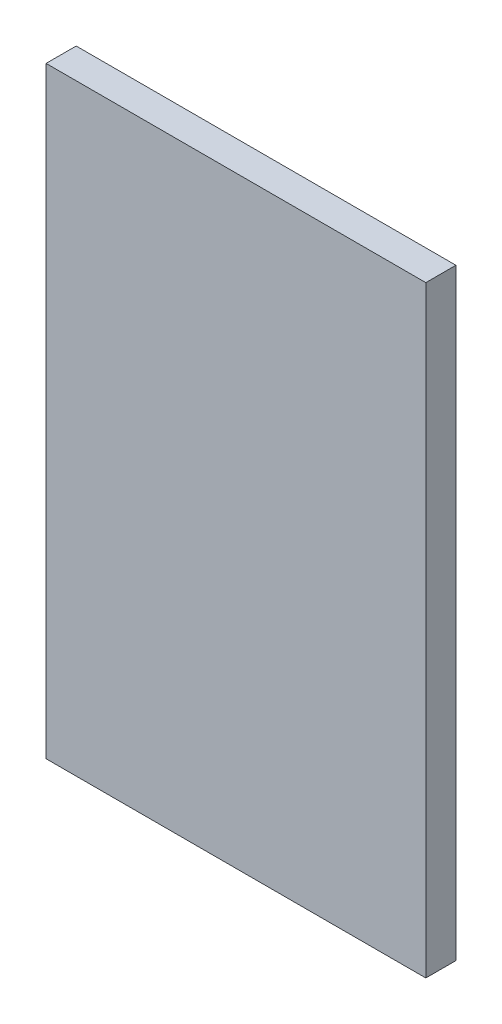
ISO-10303-21;
HEADER;
FILE_DESCRIPTION(('STEP AP214'),'2;1');
FILE_NAME('part.step','',(''),(''),'','','');
FILE_SCHEMA(('AUTOMOTIVE_DESIGN { 1 0 10303 214 1 1 1 1 }'));
ENDSEC;
DATA;
#1=APPLICATION_CONTEXT('core data for automotive mechanical design processes');
#2=APPLICATION_PROTOCOL_DEFINITION('international standard','automotive_design',2000,#1);
#3=PRODUCT_CONTEXT('',#1,'mechanical');
#4=PRODUCT('Part','Part','',(#3));
#5=PRODUCT_RELATED_PRODUCT_CATEGORY('part','',(#4));
#6=PRODUCT_DEFINITION_FORMATION('','',#4);
#7=PRODUCT_DEFINITION_CONTEXT('part definition',#1,'design');
#8=PRODUCT_DEFINITION('design','',#6,#7);
#9=PRODUCT_DEFINITION_SHAPE('','',#8);
#10=(LENGTH_UNIT() NAMED_UNIT(*) SI_UNIT(.MILLI.,.METRE.));
#11=(NAMED_UNIT(*) PLANE_ANGLE_UNIT() SI_UNIT($,.RADIAN.));
#12=(NAMED_UNIT(*) SI_UNIT($,.STERADIAN.) SOLID_ANGLE_UNIT());
#13=UNCERTAINTY_MEASURE_WITH_UNIT(LENGTH_MEASURE(1.E-05),#10,'distance_accuracy_value','');
#14=(GEOMETRIC_REPRESENTATION_CONTEXT(3) GLOBAL_UNCERTAINTY_ASSIGNED_CONTEXT((#13)) GLOBAL_UNIT_ASSIGNED_CONTEXT((#10,
#11,#12)) REPRESENTATION_CONTEXT('',''));
#15=CARTESIAN_POINT('',(0.,0.,0.));
#16=DIRECTION('',(0.,0.,1.));
#17=DIRECTION('',(1.,0.,0.));
#18=AXIS2_PLACEMENT_3D('',#15,#16,#17);
#19=CARTESIAN_POINT('',(0.,0.,44.45));
#20=DIRECTION('',(1.,0.,0.));
#21=DIRECTION('',(0.,1.,0.));
#22=AXIS2_PLACEMENT_3D('',#19,#20,#21);
#23=PLANE('',#22);
#24=DIRECTION('',(0.,-1.,0.));
#25=VECTOR('',#24,1.);
#26=CARTESIAN_POINT('',(0.,0.,0.));
#27=LINE('',#26,#25);
#28=CARTESIAN_POINT('',(0.,0.,0.));
#29=VERTEX_POINT('',#28);
#30=CARTESIAN_POINT('',(1.088711004442E-13,-889.,0.));
#31=VERTEX_POINT('',#30);
#32=EDGE_CURVE('E298',#29,#31,#27,.T.);
#33=ORIENTED_EDGE('',*,*,#32,.T.);
#34=DIRECTION('',(0.,0.,-1.));
#35=VECTOR('',#34,1.);
#36=CARTESIAN_POINT('',(1.088711004442E-13,-889.,44.45));
#37=LINE('',#36,#35);
#38=CARTESIAN_POINT('',(1.088711004442E-13,-889.,44.45));
#39=VERTEX_POINT('',#38);
#40=EDGE_CURVE('E11',#39,#31,#37,.T.);
#41=ORIENTED_EDGE('',*,*,#40,.F.);
#42=DIRECTION('',(0.,-1.,0.));
#43=VECTOR('',#42,1.);
#44=CARTESIAN_POINT('',(0.,0.,44.45));
#45=LINE('',#44,#43);
#46=CARTESIAN_POINT('',(0.,0.,44.45));
#47=VERTEX_POINT('',#46);
#48=EDGE_CURVE('E299',#47,#39,#45,.T.);
#49=ORIENTED_EDGE('',*,*,#48,.F.);
#50=DIRECTION('',(0.,0.,-1.));
#51=VECTOR('',#50,1.);
#52=CARTESIAN_POINT('',(0.,0.,44.45));
#53=LINE('',#52,#51);
#54=EDGE_CURVE('E309',#47,#29,#53,.T.);
#55=ORIENTED_EDGE('',*,*,#54,.T.);
#56=EDGE_LOOP('',(#33,#41,#49,#55));
#57=FACE_BOUND('',#56,.T.);
#58=ADVANCED_FACE('F32',(#57),#23,.F.);
#59=CARTESIAN_POINT('',(1.088711004442E-13,-889.,44.45));
#60=DIRECTION('',(0.,1.,0.));
#61=DIRECTION('',(0.,0.,1.));
#62=AXIS2_PLACEMENT_3D('',#59,#60,#61);
#63=PLANE('',#62);
#64=DIRECTION('',(1.,0.,0.));
#65=VECTOR('',#64,1.);
#66=CARTESIAN_POINT('',(1.088711004442E-13,-889.,0.));
#67=LINE('',#66,#65);
#68=CARTESIAN_POINT('',(560.57,-889.,0.));
#69=VERTEX_POINT('',#68);
#70=EDGE_CURVE('E312',#31,#69,#67,.T.);
#71=ORIENTED_EDGE('',*,*,#70,.T.);
#72=DIRECTION('',(0.,0.,-1.));
#73=VECTOR('',#72,1.);
#74=CARTESIAN_POINT('',(560.57,-889.,44.45));
#75=LINE('',#74,#73);
#76=CARTESIAN_POINT('',(560.57,-889.,44.45));
#77=VERTEX_POINT('',#76);
#78=EDGE_CURVE('E39',#77,#69,#75,.T.);
#79=ORIENTED_EDGE('',*,*,#78,.F.);
#80=DIRECTION('',(1.,0.,0.));
#81=VECTOR('',#80,1.);
#82=CARTESIAN_POINT('',(1.088711004442E-13,-889.,44.45));
#83=LINE('',#82,#81);
#84=EDGE_CURVE('E302',#39,#77,#83,.T.);
#85=ORIENTED_EDGE('',*,*,#84,.F.);
#86=ORIENTED_EDGE('',*,*,#40,.T.);
#87=EDGE_LOOP('',(#71,#79,#85,#86));
#88=FACE_BOUND('',#87,.T.);
#89=ADVANCED_FACE('F342',(#88),#63,.F.);
#90=CARTESIAN_POINT('',(560.57,0.,44.45));
#91=DIRECTION('',(-1.,0.,0.));
#92=DIRECTION('',(0.,-1.,0.));
#93=AXIS2_PLACEMENT_3D('',#90,#91,#92);
#94=PLANE('',#93);
#95=DIRECTION('',(0.,1.,0.));
#96=VECTOR('',#95,1.);
#97=CARTESIAN_POINT('',(560.57,0.,0.));
#98=LINE('',#97,#96);
#99=CARTESIAN_POINT('',(560.57,0.,0.));
#100=VERTEX_POINT('',#99);
#101=EDGE_CURVE('E314',#69,#100,#98,.T.);
#102=ORIENTED_EDGE('',*,*,#101,.T.);
#103=DIRECTION('',(0.,0.,-1.));
#104=VECTOR('',#103,1.);
#105=CARTESIAN_POINT('',(560.57,0.,44.45));
#106=LINE('',#105,#104);
#107=CARTESIAN_POINT('',(560.57,0.,44.45));
#108=VERTEX_POINT('',#107);
#109=EDGE_CURVE('E319',#108,#100,#106,.T.);
#110=ORIENTED_EDGE('',*,*,#109,.F.);
#111=DIRECTION('',(0.,1.,0.));
#112=VECTOR('',#111,1.);
#113=CARTESIAN_POINT('',(560.57,0.,44.45));
#114=LINE('',#113,#112);
#115=EDGE_CURVE('E305',#77,#108,#114,.T.);
#116=ORIENTED_EDGE('',*,*,#115,.F.);
#117=ORIENTED_EDGE('',*,*,#78,.T.);
#118=EDGE_LOOP('',(#102,#110,#116,#117));
#119=FACE_BOUND('',#118,.T.);
#120=ADVANCED_FACE('F326',(#119),#94,.F.);
#121=CARTESIAN_POINT('',(0.,0.,44.45));
#122=DIRECTION('',(0.,-1.,0.));
#123=DIRECTION('',(0.,0.,-1.));
#124=AXIS2_PLACEMENT_3D('',#121,#122,#123);
#125=PLANE('',#124);
#126=DIRECTION('',(-1.,0.,0.));
#127=VECTOR('',#126,1.);
#128=CARTESIAN_POINT('',(0.,0.,0.));
#129=LINE('',#128,#127);
#130=EDGE_CURVE('E303',#100,#29,#129,.T.);
#131=ORIENTED_EDGE('',*,*,#130,.T.);
#132=ORIENTED_EDGE('',*,*,#54,.F.);
#133=DIRECTION('',(-1.,0.,0.));
#134=VECTOR('',#133,1.);
#135=CARTESIAN_POINT('',(0.,0.,44.45));
#136=LINE('',#135,#134);
#137=EDGE_CURVE('E307',#108,#47,#136,.T.);
#138=ORIENTED_EDGE('',*,*,#137,.F.);
#139=ORIENTED_EDGE('',*,*,#109,.T.);
#140=EDGE_LOOP('',(#131,#132,#138,#139));
#141=FACE_BOUND('',#140,.T.);
#142=ADVANCED_FACE('F335',(#141),#125,.F.);
#143=CARTESIAN_POINT('',(0.,0.,44.45));
#144=DIRECTION('',(0.,0.,1.));
#145=DIRECTION('',(1.,0.,0.));
#146=AXIS2_PLACEMENT_3D('',#143,#144,#145);
#147=PLANE('',#146);
#148=ORIENTED_EDGE('',*,*,#48,.T.);
#149=ORIENTED_EDGE('',*,*,#84,.T.);
#150=ORIENTED_EDGE('',*,*,#115,.T.);
#151=ORIENTED_EDGE('',*,*,#137,.T.);
#152=EDGE_LOOP('',(#148,#149,#150,#151));
#153=FACE_BOUND('',#152,.T.);
#154=ADVANCED_FACE('F341',(#153),#147,.T.);
#155=CARTESIAN_POINT('',(0.,0.,0.));
#156=DIRECTION('',(0.,0.,1.));
#157=DIRECTION('',(1.,0.,0.));
#158=AXIS2_PLACEMENT_3D('',#155,#156,#157);
#159=PLANE('',#158);
#160=DIRECTION('',(0.,-1.,0.));
#161=VECTOR('',#160,1.);
#162=CARTESIAN_POINT('',(391.634336198421,-63.5,0.));
#163=LINE('',#162,#161);
#164=CARTESIAN_POINT('',(391.634336198421,-63.5,0.));
#165=VERTEX_POINT('',#164);
#166=CARTESIAN_POINT('',(391.634336198421,-825.5,0.));
#167=VERTEX_POINT('',#166);
#168=EDGE_CURVE('E180',#165,#167,#163,.T.);
#169=ORIENTED_EDGE('',*,*,#168,.F.);
#170=DIRECTION('',(1.,0.,0.));
#171=VECTOR('',#170,1.);
#172=CARTESIAN_POINT('',(391.634336198421,-63.5,0.));
#173=LINE('',#172,#171);
#174=CARTESIAN_POINT('',(355.50566380158,-63.5,0.));
#175=VERTEX_POINT('',#174);
#176=EDGE_CURVE('E197',#175,#165,#173,.T.);
#177=ORIENTED_EDGE('',*,*,#176,.F.);
#178=DIRECTION('',(0.,-1.,0.));
#179=VECTOR('',#178,1.);
#180=CARTESIAN_POINT('',(355.50566380158,-63.5,0.));
#181=LINE('',#180,#179);
#182=CARTESIAN_POINT('',(355.50566380158,-825.5,0.));
#183=VERTEX_POINT('',#182);
#184=EDGE_CURVE('E205',#175,#183,#181,.T.);
#185=ORIENTED_EDGE('',*,*,#184,.T.);
#186=DIRECTION('',(1.,0.,0.));
#187=VECTOR('',#186,1.);
#188=CARTESIAN_POINT('',(391.634336198421,-825.5,0.));
#189=LINE('',#188,#187);
#190=EDGE_CURVE('E185',#183,#167,#189,.T.);
#191=ORIENTED_EDGE('',*,*,#190,.T.);
#192=EDGE_LOOP('',(#169,#177,#185,#191));
#193=FACE_BOUND('',#192,.T.);
#194=DIRECTION('',(0.,-1.,0.));
#195=VECTOR('',#194,1.);
#196=CARTESIAN_POINT('',(485.13433619842,-63.4999999999999,0.));
#197=LINE('',#196,#195);
#198=CARTESIAN_POINT('',(485.13433619842,-63.4999999999999,0.));
#199=VERTEX_POINT('',#198);
#200=CARTESIAN_POINT('',(485.134336198421,-825.5,0.));
#201=VERTEX_POINT('',#200);
#202=EDGE_CURVE('E234',#199,#201,#197,.T.);
#203=ORIENTED_EDGE('',*,*,#202,.F.);
#204=DIRECTION('',(1.,0.,0.));
#205=VECTOR('',#204,1.);
#206=CARTESIAN_POINT('',(485.13433619842,-63.4999999999999,0.));
#207=LINE('',#206,#205);
#208=CARTESIAN_POINT('',(449.00566380158,-63.4999999999999,0.));
#209=VERTEX_POINT('',#208);
#210=EDGE_CURVE('E223',#209,#199,#207,.T.);
#211=ORIENTED_EDGE('',*,*,#210,.F.);
#212=DIRECTION('',(0.,-1.,0.));
#213=VECTOR('',#212,1.);
#214=CARTESIAN_POINT('',(449.00566380158,-63.4999999999999,0.));
#215=LINE('',#214,#213);
#216=CARTESIAN_POINT('',(449.00566380158,-825.5,0.));
#217=VERTEX_POINT('',#216);
#218=EDGE_CURVE('E231',#209,#217,#215,.T.);
#219=ORIENTED_EDGE('',*,*,#218,.T.);
#220=DIRECTION('',(1.,0.,0.));
#221=VECTOR('',#220,1.);
#222=CARTESIAN_POINT('',(485.134336198421,-825.5,0.));
#223=LINE('',#222,#221);
#224=EDGE_CURVE('E212',#217,#201,#223,.T.);
#225=ORIENTED_EDGE('',*,*,#224,.T.);
#226=EDGE_LOOP('',(#203,#211,#219,#225));
#227=FACE_BOUND('',#226,.T.);
#228=DIRECTION('',(0.,-1.,0.));
#229=VECTOR('',#228,1.);
#230=CARTESIAN_POINT('',(205.06433619842,-63.5,0.));
#231=LINE('',#230,#229);
#232=CARTESIAN_POINT('',(205.06433619842,-63.5,0.));
#233=VERTEX_POINT('',#232);
#234=CARTESIAN_POINT('',(205.06433619842,-825.5,0.));
#235=VERTEX_POINT('',#234);
#236=EDGE_CURVE('E263',#233,#235,#231,.T.);
#237=ORIENTED_EDGE('',*,*,#236,.F.);
#238=DIRECTION('',(-1.,0.,0.));
#239=VECTOR('',#238,1.);
#240=CARTESIAN_POINT('',(168.935663801579,-63.5,0.));
#241=LINE('',#240,#239);
#242=CARTESIAN_POINT('',(168.935663801579,-63.5,0.));
#243=VERTEX_POINT('',#242);
#244=EDGE_CURVE('E253',#233,#243,#241,.T.);
#245=ORIENTED_EDGE('',*,*,#244,.T.);
#246=DIRECTION('',(0.,-1.,0.));
#247=VECTOR('',#246,1.);
#248=CARTESIAN_POINT('',(168.935663801579,-63.5,0.));
#249=LINE('',#248,#247);
#250=CARTESIAN_POINT('',(168.935663801579,-825.5,0.));
#251=VERTEX_POINT('',#250);
#252=EDGE_CURVE('E260',#243,#251,#249,.T.);
#253=ORIENTED_EDGE('',*,*,#252,.T.);
#254=DIRECTION('',(-1.,0.,0.));
#255=VECTOR('',#254,1.);
#256=CARTESIAN_POINT('',(168.935663801579,-825.5,0.));
#257=LINE('',#256,#255);
#258=EDGE_CURVE('E243',#235,#251,#257,.T.);
#259=ORIENTED_EDGE('',*,*,#258,.F.);
#260=EDGE_LOOP('',(#237,#245,#253,#259));
#261=FACE_BOUND('',#260,.T.);
#262=DIRECTION('',(0.,-1.,0.));
#263=VECTOR('',#262,1.);
#264=CARTESIAN_POINT('',(111.56433619842,-63.5,0.));
#265=LINE('',#264,#263);
#266=CARTESIAN_POINT('',(111.56433619842,-63.5,0.));
#267=VERTEX_POINT('',#266);
#268=CARTESIAN_POINT('',(111.56433619842,-825.5,0.));
#269=VERTEX_POINT('',#268);
#270=EDGE_CURVE('E293',#267,#269,#265,.T.);
#271=ORIENTED_EDGE('',*,*,#270,.F.);
#272=DIRECTION('',(-1.,0.,0.));
#273=VECTOR('',#272,1.);
#274=CARTESIAN_POINT('',(75.4356638015795,-63.5,0.));
#275=LINE('',#274,#273);
#276=CARTESIAN_POINT('',(75.4356638015795,-63.5,0.));
#277=VERTEX_POINT('',#276);
#278=EDGE_CURVE('E283',#267,#277,#275,.T.);
#279=ORIENTED_EDGE('',*,*,#278,.T.);
#280=DIRECTION('',(0.,-1.,0.));
#281=VECTOR('',#280,1.);
#282=CARTESIAN_POINT('',(75.4356638015795,-63.5,0.));
#283=LINE('',#282,#281);
#284=CARTESIAN_POINT('',(75.4356638015795,-825.5,0.));
#285=VERTEX_POINT('',#284);
#286=EDGE_CURVE('E290',#277,#285,#283,.T.);
#287=ORIENTED_EDGE('',*,*,#286,.T.);
#288=DIRECTION('',(-1.,0.,0.));
#289=VECTOR('',#288,1.);
#290=CARTESIAN_POINT('',(75.4356638015795,-825.5,0.));
#291=LINE('',#290,#289);
#292=EDGE_CURVE('E273',#269,#285,#291,.T.);
#293=ORIENTED_EDGE('',*,*,#292,.F.);
#294=EDGE_LOOP('',(#271,#279,#287,#293));
#295=FACE_BOUND('',#294,.T.);
#296=ORIENTED_EDGE('',*,*,#32,.F.);
#297=ORIENTED_EDGE('',*,*,#130,.F.);
#298=ORIENTED_EDGE('',*,*,#101,.F.);
#299=ORIENTED_EDGE('',*,*,#70,.F.);
#300=EDGE_LOOP('',(#296,#297,#298,#299));
#301=FACE_BOUND('',#300,.T.);
#302=ADVANCED_FACE('F332',(#193,#227,#261,#295,#301),#159,.F.);
#303=CARTESIAN_POINT('',(93.5,-63.5,3.95167314785035));
#304=DIRECTION('',(0.,-1.,0.));
#305=DIRECTION('',(0.,0.,-1.));
#306=AXIS2_PLACEMENT_3D('',#303,#304,#305);
#307=CYLINDRICAL_SURFACE('',#306,19.05);
#308=DIRECTION('',(0.,-1.,0.));
#309=VECTOR('',#308,1.);
#310=CARTESIAN_POINT('',(75.4356638015795,-63.5,10.));
#311=LINE('',#310,#309);
#312=CARTESIAN_POINT('',(75.4356638015795,-63.5,10.));
#313=VERTEX_POINT('',#312);
#314=CARTESIAN_POINT('',(75.4356638015795,-825.5,10.));
#315=VERTEX_POINT('',#314);
#316=EDGE_CURVE('E288',#313,#315,#311,.T.);
#317=ORIENTED_EDGE('',*,*,#316,.F.);
#318=CARTESIAN_POINT('',(93.5,-63.5,3.95167314785035));
#319=DIRECTION('',(0.,1.,0.));
#320=DIRECTION('',(0.,0.,1.));
#321=AXIS2_PLACEMENT_3D('',#318,#319,#320);
#322=CIRCLE('',#321,19.05);
#323=CARTESIAN_POINT('',(111.56433619842,-63.5,10.));
#324=VERTEX_POINT('',#323);
#325=EDGE_CURVE('E278',#313,#324,#322,.T.);
#326=ORIENTED_EDGE('',*,*,#325,.T.);
#327=DIRECTION('',(0.,-1.,0.));
#328=VECTOR('',#327,1.);
#329=CARTESIAN_POINT('',(111.56433619842,-63.5,10.));
#330=LINE('',#329,#328);
#331=CARTESIAN_POINT('',(111.56433619842,-825.5,10.));
#332=VERTEX_POINT('',#331);
#333=EDGE_CURVE('E296',#324,#332,#330,.T.);
#334=ORIENTED_EDGE('',*,*,#333,.T.);
#335=CARTESIAN_POINT('',(93.5,-825.5,3.95167314785035));
#336=DIRECTION('',(0.,1.,0.));
#337=DIRECTION('',(0.,0.,1.));
#338=AXIS2_PLACEMENT_3D('',#335,#336,#337);
#339=CIRCLE('',#338,19.05);
#340=EDGE_CURVE('E268',#315,#332,#339,.T.);
#341=ORIENTED_EDGE('',*,*,#340,.F.);
#342=EDGE_LOOP('',(#317,#326,#334,#341));
#343=FACE_BOUND('',#342,.T.);
#344=ADVANCED_FACE('F354',(#343),#307,.F.);
#345=CARTESIAN_POINT('',(111.56433619842,-63.5,0.));
#346=DIRECTION('',(-1.,0.,0.));
#347=DIRECTION('',(0.,0.,1.));
#348=AXIS2_PLACEMENT_3D('',#345,#346,#347);
#349=PLANE('',#348);
#350=ORIENTED_EDGE('',*,*,#333,.F.);
#351=DIRECTION('',(0.,0.,-1.));
#352=VECTOR('',#351,1.);
#353=CARTESIAN_POINT('',(111.56433619842,-63.5,0.));
#354=LINE('',#353,#352);
#355=EDGE_CURVE('E281',#324,#267,#354,.T.);
#356=ORIENTED_EDGE('',*,*,#355,.T.);
#357=ORIENTED_EDGE('',*,*,#270,.T.);
#358=DIRECTION('',(0.,0.,-1.));
#359=VECTOR('',#358,1.);
#360=CARTESIAN_POINT('',(111.56433619842,-825.5,0.));
#361=LINE('',#360,#359);
#362=EDGE_CURVE('E271',#332,#269,#361,.T.);
#363=ORIENTED_EDGE('',*,*,#362,.F.);
#364=EDGE_LOOP('',(#350,#356,#357,#363));
#365=FACE_BOUND('',#364,.T.);
#366=ADVANCED_FACE('F360',(#365),#349,.T.);
#367=CARTESIAN_POINT('',(75.4356638015795,-63.5,10.));
#368=DIRECTION('',(1.,0.,0.));
#369=DIRECTION('',(0.,0.,-1.));
#370=AXIS2_PLACEMENT_3D('',#367,#368,#369);
#371=PLANE('',#370);
#372=ORIENTED_EDGE('',*,*,#286,.F.);
#373=DIRECTION('',(0.,0.,1.));
#374=VECTOR('',#373,1.);
#375=CARTESIAN_POINT('',(75.4356638015795,-63.5,10.));
#376=LINE('',#375,#374);
#377=EDGE_CURVE('E286',#277,#313,#376,.T.);
#378=ORIENTED_EDGE('',*,*,#377,.T.);
#379=ORIENTED_EDGE('',*,*,#316,.T.);
#380=DIRECTION('',(0.,0.,1.));
#381=VECTOR('',#380,1.);
#382=CARTESIAN_POINT('',(75.4356638015795,-825.5,10.));
#383=LINE('',#382,#381);
#384=EDGE_CURVE('E275',#285,#315,#383,.T.);
#385=ORIENTED_EDGE('',*,*,#384,.F.);
#386=EDGE_LOOP('',(#372,#378,#379,#385));
#387=FACE_BOUND('',#386,.T.);
#388=ADVANCED_FACE('F364',(#387),#371,.T.);
#389=CARTESIAN_POINT('',(93.5,-63.5,3.95167314785035));
#390=DIRECTION('',(0.,1.,0.));
#391=DIRECTION('',(0.,0.,1.));
#392=AXIS2_PLACEMENT_3D('',#389,#390,#391);
#393=PLANE('',#392);
#394=ORIENTED_EDGE('',*,*,#325,.F.);
#395=ORIENTED_EDGE('',*,*,#377,.F.);
#396=ORIENTED_EDGE('',*,*,#278,.F.);
#397=ORIENTED_EDGE('',*,*,#355,.F.);
#398=EDGE_LOOP('',(#394,#395,#396,#397));
#399=FACE_BOUND('',#398,.T.);
#400=ADVANCED_FACE('F368',(#399),#393,.F.);
#401=CARTESIAN_POINT('',(93.5,-825.5,3.95167314785035));
#402=DIRECTION('',(0.,1.,0.));
#403=DIRECTION('',(0.,0.,1.));
#404=AXIS2_PLACEMENT_3D('',#401,#402,#403);
#405=PLANE('',#404);
#406=ORIENTED_EDGE('',*,*,#340,.T.);
#407=ORIENTED_EDGE('',*,*,#362,.T.);
#408=ORIENTED_EDGE('',*,*,#292,.T.);
#409=ORIENTED_EDGE('',*,*,#384,.T.);
#410=EDGE_LOOP('',(#406,#407,#408,#409));
#411=FACE_BOUND('',#410,.T.);
#412=ADVANCED_FACE('F372',(#411),#405,.T.);
#413=CARTESIAN_POINT('',(187.,-63.5,3.95167314785035));
#414=DIRECTION('',(0.,-1.,0.));
#415=DIRECTION('',(0.,0.,-1.));
#416=AXIS2_PLACEMENT_3D('',#413,#414,#415);
#417=CYLINDRICAL_SURFACE('',#416,19.05);
#418=DIRECTION('',(0.,-1.,0.));
#419=VECTOR('',#418,1.);
#420=CARTESIAN_POINT('',(168.935663801579,-63.5,10.));
#421=LINE('',#420,#419);
#422=CARTESIAN_POINT('',(168.935663801579,-63.5,10.));
#423=VERTEX_POINT('',#422);
#424=CARTESIAN_POINT('',(168.935663801579,-825.5,10.));
#425=VERTEX_POINT('',#424);
#426=EDGE_CURVE('E258',#423,#425,#421,.T.);
#427=ORIENTED_EDGE('',*,*,#426,.F.);
#428=CARTESIAN_POINT('',(187.,-63.5,3.95167314785035));
#429=DIRECTION('',(0.,1.,0.));
#430=DIRECTION('',(0.,0.,1.));
#431=AXIS2_PLACEMENT_3D('',#428,#429,#430);
#432=CIRCLE('',#431,19.05);
#433=CARTESIAN_POINT('',(205.06433619842,-63.5,10.));
#434=VERTEX_POINT('',#433);
#435=EDGE_CURVE('E248',#423,#434,#432,.T.);
#436=ORIENTED_EDGE('',*,*,#435,.T.);
#437=DIRECTION('',(0.,-1.,0.));
#438=VECTOR('',#437,1.);
#439=CARTESIAN_POINT('',(205.06433619842,-63.5,10.));
#440=LINE('',#439,#438);
#441=CARTESIAN_POINT('',(205.06433619842,-825.5,10.));
#442=VERTEX_POINT('',#441);
#443=EDGE_CURVE('E266',#434,#442,#440,.T.);
#444=ORIENTED_EDGE('',*,*,#443,.T.);
#445=CARTESIAN_POINT('',(187.,-825.5,3.95167314785035));
#446=DIRECTION('',(0.,1.,0.));
#447=DIRECTION('',(0.,0.,1.));
#448=AXIS2_PLACEMENT_3D('',#445,#446,#447);
#449=CIRCLE('',#448,19.05);
#450=EDGE_CURVE('E238',#425,#442,#449,.T.);
#451=ORIENTED_EDGE('',*,*,#450,.F.);
#452=EDGE_LOOP('',(#427,#436,#444,#451));
#453=FACE_BOUND('',#452,.T.);
#454=ADVANCED_FACE('F376',(#453),#417,.F.);
#455=CARTESIAN_POINT('',(205.06433619842,-63.5,0.));
#456=DIRECTION('',(-1.,0.,0.));
#457=DIRECTION('',(0.,0.,1.));
#458=AXIS2_PLACEMENT_3D('',#455,#456,#457);
#459=PLANE('',#458);
#460=ORIENTED_EDGE('',*,*,#443,.F.);
#461=DIRECTION('',(0.,0.,-1.));
#462=VECTOR('',#461,1.);
#463=CARTESIAN_POINT('',(205.06433619842,-63.5,0.));
#464=LINE('',#463,#462);
#465=EDGE_CURVE('E251',#434,#233,#464,.T.);
#466=ORIENTED_EDGE('',*,*,#465,.T.);
#467=ORIENTED_EDGE('',*,*,#236,.T.);
#468=DIRECTION('',(0.,0.,-1.));
#469=VECTOR('',#468,1.);
#470=CARTESIAN_POINT('',(205.06433619842,-825.5,0.));
#471=LINE('',#470,#469);
#472=EDGE_CURVE('E241',#442,#235,#471,.T.);
#473=ORIENTED_EDGE('',*,*,#472,.F.);
#474=EDGE_LOOP('',(#460,#466,#467,#473));
#475=FACE_BOUND('',#474,.T.);
#476=ADVANCED_FACE('F380',(#475),#459,.T.);
#477=CARTESIAN_POINT('',(168.935663801579,-63.5,10.));
#478=DIRECTION('',(1.,0.,0.));
#479=DIRECTION('',(0.,0.,-1.));
#480=AXIS2_PLACEMENT_3D('',#477,#478,#479);
#481=PLANE('',#480);
#482=ORIENTED_EDGE('',*,*,#252,.F.);
#483=DIRECTION('',(0.,0.,1.));
#484=VECTOR('',#483,1.);
#485=CARTESIAN_POINT('',(168.935663801579,-63.5,10.));
#486=LINE('',#485,#484);
#487=EDGE_CURVE('E256',#243,#423,#486,.T.);
#488=ORIENTED_EDGE('',*,*,#487,.T.);
#489=ORIENTED_EDGE('',*,*,#426,.T.);
#490=DIRECTION('',(0.,0.,1.));
#491=VECTOR('',#490,1.);
#492=CARTESIAN_POINT('',(168.935663801579,-825.5,10.));
#493=LINE('',#492,#491);
#494=EDGE_CURVE('E245',#251,#425,#493,.T.);
#495=ORIENTED_EDGE('',*,*,#494,.F.);
#496=EDGE_LOOP('',(#482,#488,#489,#495));
#497=FACE_BOUND('',#496,.T.);
#498=ADVANCED_FACE('F384',(#497),#481,.T.);
#499=CARTESIAN_POINT('',(187.,-63.5,3.95167314785035));
#500=DIRECTION('',(0.,1.,0.));
#501=DIRECTION('',(0.,0.,1.));
#502=AXIS2_PLACEMENT_3D('',#499,#500,#501);
#503=PLANE('',#502);
#504=ORIENTED_EDGE('',*,*,#435,.F.);
#505=ORIENTED_EDGE('',*,*,#487,.F.);
#506=ORIENTED_EDGE('',*,*,#244,.F.);
#507=ORIENTED_EDGE('',*,*,#465,.F.);
#508=EDGE_LOOP('',(#504,#505,#506,#507));
#509=FACE_BOUND('',#508,.T.);
#510=ADVANCED_FACE('F388',(#509),#503,.F.);
#511=CARTESIAN_POINT('',(187.,-825.5,3.95167314785035));
#512=DIRECTION('',(0.,1.,0.));
#513=DIRECTION('',(0.,0.,1.));
#514=AXIS2_PLACEMENT_3D('',#511,#512,#513);
#515=PLANE('',#514);
#516=ORIENTED_EDGE('',*,*,#450,.T.);
#517=ORIENTED_EDGE('',*,*,#472,.T.);
#518=ORIENTED_EDGE('',*,*,#258,.T.);
#519=ORIENTED_EDGE('',*,*,#494,.T.);
#520=EDGE_LOOP('',(#516,#517,#518,#519));
#521=FACE_BOUND('',#520,.T.);
#522=ADVANCED_FACE('F392',(#521),#515,.T.);
#523=CARTESIAN_POINT('',(467.07,-63.4999999999999,3.95167314785035));
#524=DIRECTION('',(0.,-1.,0.));
#525=DIRECTION('',(1.,0.,0.));
#526=AXIS2_PLACEMENT_3D('',#523,#524,#525);
#527=CYLINDRICAL_SURFACE('',#526,19.05);
#528=DIRECTION('',(0.,-1.,0.));
#529=VECTOR('',#528,1.);
#530=CARTESIAN_POINT('',(449.00566380158,-63.4999999999999,10.));
#531=LINE('',#530,#529);
#532=CARTESIAN_POINT('',(449.00566380158,-63.4999999999999,10.));
#533=VERTEX_POINT('',#532);
#534=CARTESIAN_POINT('',(449.00566380158,-825.5,10.));
#535=VERTEX_POINT('',#534);
#536=EDGE_CURVE('E229',#533,#535,#531,.T.);
#537=ORIENTED_EDGE('',*,*,#536,.F.);
#538=CARTESIAN_POINT('',(467.07,-63.4999999999999,3.95167314785035));
#539=DIRECTION('',(0.,-1.,0.));
#540=DIRECTION('',(0.,0.,1.));
#541=AXIS2_PLACEMENT_3D('',#538,#539,#540);
#542=CIRCLE('',#541,19.05);
#543=CARTESIAN_POINT('',(485.13433619842,-63.4999999999999,10.));
#544=VERTEX_POINT('',#543);
#545=EDGE_CURVE('E217',#544,#533,#542,.T.);
#546=ORIENTED_EDGE('',*,*,#545,.F.);
#547=DIRECTION('',(0.,-1.,0.));
#548=VECTOR('',#547,1.);
#549=CARTESIAN_POINT('',(485.13433619842,-63.4999999999999,10.));
#550=LINE('',#549,#548);
#551=CARTESIAN_POINT('',(485.134336198421,-825.5,10.));
#552=VERTEX_POINT('',#551);
#553=EDGE_CURVE('E236',#544,#552,#550,.T.);
#554=ORIENTED_EDGE('',*,*,#553,.T.);
#555=CARTESIAN_POINT('',(467.07,-825.5,3.95167314785035));
#556=DIRECTION('',(0.,-1.,0.));
#557=DIRECTION('',(0.,0.,1.));
#558=AXIS2_PLACEMENT_3D('',#555,#556,#557);
#559=CIRCLE('',#558,19.05);
#560=EDGE_CURVE('E179',#552,#535,#559,.T.);
#561=ORIENTED_EDGE('',*,*,#560,.T.);
#562=EDGE_LOOP('',(#537,#546,#554,#561));
#563=FACE_BOUND('',#562,.T.);
#564=ADVANCED_FACE('F396',(#563),#527,.F.);
#565=CARTESIAN_POINT('',(485.13433619842,-63.4999999999999,10.));
#566=DIRECTION('',(1.,0.,0.));
#567=DIRECTION('',(0.,1.,0.));
#568=AXIS2_PLACEMENT_3D('',#565,#566,#567);
#569=PLANE('',#568);
#570=ORIENTED_EDGE('',*,*,#553,.F.);
#571=DIRECTION('',(0.,0.,1.));
#572=VECTOR('',#571,1.);
#573=CARTESIAN_POINT('',(485.13433619842,-63.4999999999999,10.));
#574=LINE('',#573,#572);
#575=EDGE_CURVE('E220',#199,#544,#574,.T.);
#576=ORIENTED_EDGE('',*,*,#575,.F.);
#577=ORIENTED_EDGE('',*,*,#202,.T.);
#578=DIRECTION('',(0.,0.,1.));
#579=VECTOR('',#578,1.);
#580=CARTESIAN_POINT('',(485.134336198421,-825.5,10.));
#581=LINE('',#580,#579);
#582=EDGE_CURVE('E54',#201,#552,#581,.T.);
#583=ORIENTED_EDGE('',*,*,#582,.T.);
#584=EDGE_LOOP('',(#570,#576,#577,#583));
#585=FACE_BOUND('',#584,.T.);
#586=ADVANCED_FACE('F400',(#585),#569,.F.);
#587=CARTESIAN_POINT('',(449.00566380158,-63.4999999999999,0.));
#588=DIRECTION('',(-1.,0.,0.));
#589=DIRECTION('',(0.,-1.,0.));
#590=AXIS2_PLACEMENT_3D('',#587,#588,#589);
#591=PLANE('',#590);
#592=ORIENTED_EDGE('',*,*,#218,.F.);
#593=DIRECTION('',(0.,0.,-1.));
#594=VECTOR('',#593,1.);
#595=CARTESIAN_POINT('',(449.00566380158,-63.4999999999999,0.));
#596=LINE('',#595,#594);
#597=EDGE_CURVE('E226',#533,#209,#596,.T.);
#598=ORIENTED_EDGE('',*,*,#597,.F.);
#599=ORIENTED_EDGE('',*,*,#536,.T.);
#600=DIRECTION('',(0.,0.,-1.));
#601=VECTOR('',#600,1.);
#602=CARTESIAN_POINT('',(449.00566380158,-825.5,0.));
#603=LINE('',#602,#601);
#604=EDGE_CURVE('E215',#535,#217,#603,.T.);
#605=ORIENTED_EDGE('',*,*,#604,.T.);
#606=EDGE_LOOP('',(#592,#598,#599,#605));
#607=FACE_BOUND('',#606,.T.);
#608=ADVANCED_FACE('F404',(#607),#591,.F.);
#609=CARTESIAN_POINT('',(467.07,-63.4999999999999,3.95167314785035));
#610=DIRECTION('',(0.,1.,0.));
#611=DIRECTION('',(0.,0.,1.));
#612=AXIS2_PLACEMENT_3D('',#609,#610,#611);
#613=PLANE('',#612);
#614=ORIENTED_EDGE('',*,*,#545,.T.);
#615=ORIENTED_EDGE('',*,*,#597,.T.);
#616=ORIENTED_EDGE('',*,*,#210,.T.);
#617=ORIENTED_EDGE('',*,*,#575,.T.);
#618=EDGE_LOOP('',(#614,#615,#616,#617));
#619=FACE_BOUND('',#618,.T.);
#620=ADVANCED_FACE('F408',(#619),#613,.F.);
#621=CARTESIAN_POINT('',(467.07,-825.5,3.95167314785035));
#622=DIRECTION('',(0.,1.,0.));
#623=DIRECTION('',(0.,0.,1.));
#624=AXIS2_PLACEMENT_3D('',#621,#622,#623);
#625=PLANE('',#624);
#626=ORIENTED_EDGE('',*,*,#560,.F.);
#627=ORIENTED_EDGE('',*,*,#582,.F.);
#628=ORIENTED_EDGE('',*,*,#224,.F.);
#629=ORIENTED_EDGE('',*,*,#604,.F.);
#630=EDGE_LOOP('',(#626,#627,#628,#629));
#631=FACE_BOUND('',#630,.T.);
#632=ADVANCED_FACE('F412',(#631),#625,.T.);
#633=CARTESIAN_POINT('',(373.57,-63.5,3.95167314785035));
#634=DIRECTION('',(0.,-1.,0.));
#635=DIRECTION('',(1.,0.,0.));
#636=AXIS2_PLACEMENT_3D('',#633,#634,#635);
#637=CYLINDRICAL_SURFACE('',#636,19.05);
#638=DIRECTION('',(0.,-1.,0.));
#639=VECTOR('',#638,1.);
#640=CARTESIAN_POINT('',(355.50566380158,-63.5,10.));
#641=LINE('',#640,#639);
#642=CARTESIAN_POINT('',(355.50566380158,-63.5,10.));
#643=VERTEX_POINT('',#642);
#644=CARTESIAN_POINT('',(355.50566380158,-825.5,10.));
#645=VERTEX_POINT('',#644);
#646=EDGE_CURVE('E203',#643,#645,#641,.T.);
#647=ORIENTED_EDGE('',*,*,#646,.F.);
#648=CARTESIAN_POINT('',(373.57,-63.5,3.95167314785035));
#649=DIRECTION('',(0.,-1.,0.));
#650=DIRECTION('',(0.,0.,1.));
#651=AXIS2_PLACEMENT_3D('',#648,#649,#650);
#652=CIRCLE('',#651,19.05);
#653=CARTESIAN_POINT('',(391.634336198421,-63.5,10.));
#654=VERTEX_POINT('',#653);
#655=EDGE_CURVE('E176',#654,#643,#652,.T.);
#656=ORIENTED_EDGE('',*,*,#655,.F.);
#657=DIRECTION('',(0.,-1.,0.));
#658=VECTOR('',#657,1.);
#659=CARTESIAN_POINT('',(391.634336198421,-63.5,10.));
#660=LINE('',#659,#658);
#661=CARTESIAN_POINT('',(391.634336198421,-825.5,10.));
#662=VERTEX_POINT('',#661);
#663=EDGE_CURVE('E172',#654,#662,#660,.T.);
#664=ORIENTED_EDGE('',*,*,#663,.T.);
#665=CARTESIAN_POINT('',(373.57,-825.5,3.95167314785035));
#666=DIRECTION('',(0.,-1.,0.));
#667=DIRECTION('',(0.,0.,1.));
#668=AXIS2_PLACEMENT_3D('',#665,#666,#667);
#669=CIRCLE('',#668,19.05);
#670=EDGE_CURVE('E174',#662,#645,#669,.T.);
#671=ORIENTED_EDGE('',*,*,#670,.T.);
#672=EDGE_LOOP('',(#647,#656,#664,#671));
#673=FACE_BOUND('',#672,.T.);
#674=ADVANCED_FACE('F173',(#673),#637,.F.);
#675=CARTESIAN_POINT('',(391.634336198421,-63.5,10.));
#676=DIRECTION('',(1.,0.,0.));
#677=DIRECTION('',(0.,1.,0.));
#678=AXIS2_PLACEMENT_3D('',#675,#676,#677);
#679=PLANE('',#678);
#680=ORIENTED_EDGE('',*,*,#663,.F.);
#681=DIRECTION('',(0.,0.,1.));
#682=VECTOR('',#681,1.);
#683=CARTESIAN_POINT('',(391.634336198421,-63.5,10.));
#684=LINE('',#683,#682);
#685=EDGE_CURVE('E195',#165,#654,#684,.T.);
#686=ORIENTED_EDGE('',*,*,#685,.F.);
#687=ORIENTED_EDGE('',*,*,#168,.T.);
#688=DIRECTION('',(0.,0.,1.));
#689=VECTOR('',#688,1.);
#690=CARTESIAN_POINT('',(391.634336198421,-825.5,10.));
#691=LINE('',#690,#689);
#692=EDGE_CURVE('E46',#167,#662,#691,.T.);
#693=ORIENTED_EDGE('',*,*,#692,.T.);
#694=EDGE_LOOP('',(#680,#686,#687,#693));
#695=FACE_BOUND('',#694,.T.);
#696=ADVANCED_FACE('F182',(#695),#679,.F.);
#697=CARTESIAN_POINT('',(355.50566380158,-63.5,0.));
#698=DIRECTION('',(-1.,0.,0.));
#699=DIRECTION('',(0.,-1.,0.));
#700=AXIS2_PLACEMENT_3D('',#697,#698,#699);
#701=PLANE('',#700);
#702=ORIENTED_EDGE('',*,*,#184,.F.);
#703=DIRECTION('',(0.,0.,-1.));
#704=VECTOR('',#703,1.);
#705=CARTESIAN_POINT('',(355.50566380158,-63.5,0.));
#706=LINE('',#705,#704);
#707=EDGE_CURVE('E200',#643,#175,#706,.T.);
#708=ORIENTED_EDGE('',*,*,#707,.F.);
#709=ORIENTED_EDGE('',*,*,#646,.T.);
#710=DIRECTION('',(0.,0.,-1.));
#711=VECTOR('',#710,1.);
#712=CARTESIAN_POINT('',(355.50566380158,-825.5,0.));
#713=LINE('',#712,#711);
#714=EDGE_CURVE('E189',#645,#183,#713,.T.);
#715=ORIENTED_EDGE('',*,*,#714,.T.);
#716=EDGE_LOOP('',(#702,#708,#709,#715));
#717=FACE_BOUND('',#716,.T.);
#718=ADVANCED_FACE('F420',(#717),#701,.F.);
#719=CARTESIAN_POINT('',(373.57,-63.5,3.95167314785035));
#720=DIRECTION('',(0.,1.,0.));
#721=DIRECTION('',(0.,0.,1.));
#722=AXIS2_PLACEMENT_3D('',#719,#720,#721);
#723=PLANE('',#722);
#724=ORIENTED_EDGE('',*,*,#655,.T.);
#725=ORIENTED_EDGE('',*,*,#707,.T.);
#726=ORIENTED_EDGE('',*,*,#176,.T.);
#727=ORIENTED_EDGE('',*,*,#685,.T.);
#728=EDGE_LOOP('',(#724,#725,#726,#727));
#729=FACE_BOUND('',#728,.T.);
#730=ADVANCED_FACE('F423',(#729),#723,.F.);
#731=CARTESIAN_POINT('',(373.57,-825.5,3.95167314785035));
#732=DIRECTION('',(0.,1.,0.));
#733=DIRECTION('',(0.,0.,1.));
#734=AXIS2_PLACEMENT_3D('',#731,#732,#733);
#735=PLANE('',#734);
#736=ORIENTED_EDGE('',*,*,#670,.F.);
#737=ORIENTED_EDGE('',*,*,#692,.F.);
#738=ORIENTED_EDGE('',*,*,#190,.F.);
#739=ORIENTED_EDGE('',*,*,#714,.F.);
#740=EDGE_LOOP('',(#736,#737,#738,#739));
#741=FACE_BOUND('',#740,.T.);
#742=ADVANCED_FACE('F188',(#741),#735,.T.);
#743=CLOSED_SHELL('',(#58,#89,#120,#142,#154,#302,#344,#366,#388,#400,#412,#454,#476,#498,#510,
#522,#564,#586,#608,#620,#632,#674,#696,#718,#730,#742));
#744=MANIFOLD_SOLID_BREP('B2',#743);
#745=ADVANCED_BREP_SHAPE_REPRESENTATION('',(#18,#744),#14);
#746=SHAPE_DEFINITION_REPRESENTATION(#9,#745);
ENDSEC;
END-ISO-10303-21;
